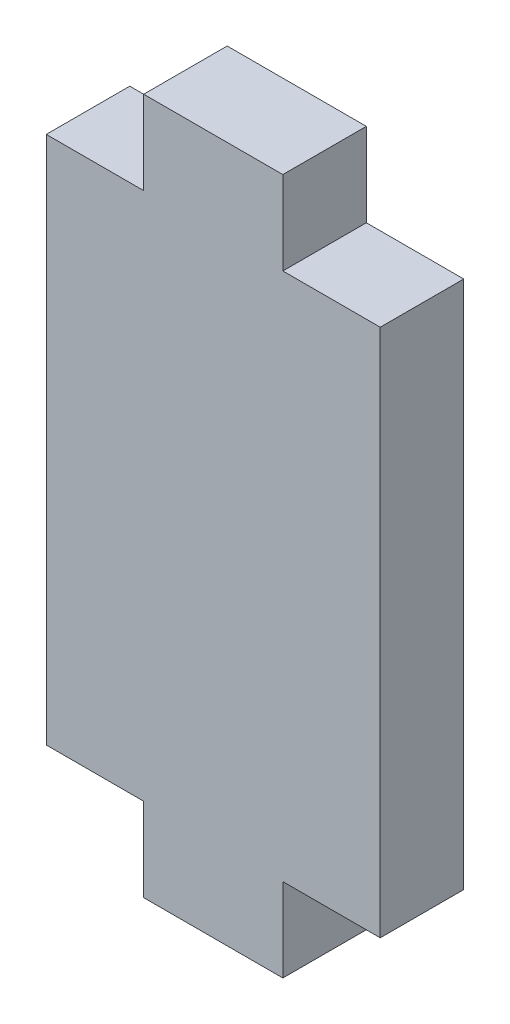
ISO-10303-21;
HEADER;
FILE_DESCRIPTION(('STEP AP214'),'2;1');
FILE_NAME('part.step','',(''),(''),'','','');
FILE_SCHEMA(('AUTOMOTIVE_DESIGN { 1 0 10303 214 1 1 1 1 }'));
ENDSEC;
DATA;
#1=APPLICATION_CONTEXT('core data for automotive mechanical design processes');
#2=APPLICATION_PROTOCOL_DEFINITION('international standard','automotive_design',2000,#1);
#3=PRODUCT_CONTEXT('',#1,'mechanical');
#4=PRODUCT('Part','Part','',(#3));
#5=PRODUCT_RELATED_PRODUCT_CATEGORY('part','',(#4));
#6=PRODUCT_DEFINITION_FORMATION('','',#4);
#7=PRODUCT_DEFINITION_CONTEXT('part definition',#1,'design');
#8=PRODUCT_DEFINITION('design','',#6,#7);
#9=PRODUCT_DEFINITION_SHAPE('','',#8);
#10=(LENGTH_UNIT() NAMED_UNIT(*) SI_UNIT(.MILLI.,.METRE.));
#11=(NAMED_UNIT(*) PLANE_ANGLE_UNIT() SI_UNIT($,.RADIAN.));
#12=(NAMED_UNIT(*) SI_UNIT($,.STERADIAN.) SOLID_ANGLE_UNIT());
#13=UNCERTAINTY_MEASURE_WITH_UNIT(LENGTH_MEASURE(1.E-05),#10,'distance_accuracy_value','');
#14=(GEOMETRIC_REPRESENTATION_CONTEXT(3) GLOBAL_UNCERTAINTY_ASSIGNED_CONTEXT((#13)) GLOBAL_UNIT_ASSIGNED_CONTEXT((#10,
#11,#12)) REPRESENTATION_CONTEXT('',''));
#15=CARTESIAN_POINT('',(0.,0.,0.));
#16=DIRECTION('',(0.,0.,1.));
#17=DIRECTION('',(1.,0.,0.));
#18=AXIS2_PLACEMENT_3D('',#15,#16,#17);
#19=CARTESIAN_POINT('',(6.,-9.49999999999999,3.));
#20=DIRECTION('',(0.,1.,0.));
#21=DIRECTION('',(0.,0.,1.));
#22=AXIS2_PLACEMENT_3D('',#19,#20,#21);
#23=PLANE('',#22);
#24=DIRECTION('',(1.,0.,0.));
#25=VECTOR('',#24,1.);
#26=CARTESIAN_POINT('',(6.,-9.49999999999999,0.));
#27=LINE('',#26,#25);
#28=CARTESIAN_POINT('',(2.5,-9.49999999999999,0.));
#29=VERTEX_POINT('',#28);
#30=CARTESIAN_POINT('',(6.,-9.49999999999999,0.));
#31=VERTEX_POINT('',#30);
#32=EDGE_CURVE('E154',#29,#31,#27,.T.);
#33=ORIENTED_EDGE('',*,*,#32,.T.);
#34=DIRECTION('',(0.,0.,-1.));
#35=VECTOR('',#34,1.);
#36=CARTESIAN_POINT('',(6.,-9.49999999999999,3.));
#37=LINE('',#36,#35);
#38=CARTESIAN_POINT('',(6.,-9.49999999999999,3.));
#39=VERTEX_POINT('',#38);
#40=EDGE_CURVE('E11',#39,#31,#37,.T.);
#41=ORIENTED_EDGE('',*,*,#40,.F.);
#42=DIRECTION('',(1.,0.,0.));
#43=VECTOR('',#42,1.);
#44=CARTESIAN_POINT('',(6.,-9.49999999999999,3.));
#45=LINE('',#44,#43);
#46=CARTESIAN_POINT('',(2.5,-9.49999999999999,3.));
#47=VERTEX_POINT('',#46);
#48=EDGE_CURVE('E176',#47,#39,#45,.T.);
#49=ORIENTED_EDGE('',*,*,#48,.F.);
#50=DIRECTION('',(0.,0.,-1.));
#51=VECTOR('',#50,1.);
#52=CARTESIAN_POINT('',(2.5,-9.49999999999999,3.));
#53=LINE('',#52,#51);
#54=EDGE_CURVE('E150',#47,#29,#53,.T.);
#55=ORIENTED_EDGE('',*,*,#54,.T.);
#56=EDGE_LOOP('',(#33,#41,#49,#55));
#57=FACE_BOUND('',#56,.T.);
#58=ADVANCED_FACE('F34',(#57),#23,.F.);
#59=CARTESIAN_POINT('',(6.,9.50000000000001,3.));
#60=DIRECTION('',(-1.,0.,0.));
#61=DIRECTION('',(0.,-1.,0.));
#62=AXIS2_PLACEMENT_3D('',#59,#60,#61);
#63=PLANE('',#62);
#64=DIRECTION('',(0.,1.,0.));
#65=VECTOR('',#64,1.);
#66=CARTESIAN_POINT('',(6.,9.50000000000001,0.));
#67=LINE('',#66,#65);
#68=CARTESIAN_POINT('',(6.,9.50000000000001,0.));
#69=VERTEX_POINT('',#68);
#70=EDGE_CURVE('E157',#31,#69,#67,.T.);
#71=ORIENTED_EDGE('',*,*,#70,.T.);
#72=DIRECTION('',(0.,0.,-1.));
#73=VECTOR('',#72,1.);
#74=CARTESIAN_POINT('',(6.,9.50000000000001,3.));
#75=LINE('',#74,#73);
#76=CARTESIAN_POINT('',(6.,9.50000000000001,3.));
#77=VERTEX_POINT('',#76);
#78=EDGE_CURVE('E42',#77,#69,#75,.T.);
#79=ORIENTED_EDGE('',*,*,#78,.F.);
#80=DIRECTION('',(0.,1.,0.));
#81=VECTOR('',#80,1.);
#82=CARTESIAN_POINT('',(6.,9.50000000000001,3.));
#83=LINE('',#82,#81);
#84=EDGE_CURVE('E105',#39,#77,#83,.T.);
#85=ORIENTED_EDGE('',*,*,#84,.F.);
#86=ORIENTED_EDGE('',*,*,#40,.T.);
#87=EDGE_LOOP('',(#71,#79,#85,#86));
#88=FACE_BOUND('',#87,.T.);
#89=ADVANCED_FACE('F254',(#88),#63,.F.);
#90=CARTESIAN_POINT('',(2.5,9.50000000000001,3.));
#91=DIRECTION('',(0.,-1.,0.));
#92=DIRECTION('',(0.,0.,-1.));
#93=AXIS2_PLACEMENT_3D('',#90,#91,#92);
#94=PLANE('',#93);
#95=DIRECTION('',(-1.,0.,0.));
#96=VECTOR('',#95,1.);
#97=CARTESIAN_POINT('',(2.5,9.50000000000001,0.));
#98=LINE('',#97,#96);
#99=CARTESIAN_POINT('',(2.5,9.50000000000001,0.));
#100=VERTEX_POINT('',#99);
#101=EDGE_CURVE('E159',#69,#100,#98,.T.);
#102=ORIENTED_EDGE('',*,*,#101,.T.);
#103=DIRECTION('',(0.,0.,-1.));
#104=VECTOR('',#103,1.);
#105=CARTESIAN_POINT('',(2.5,9.50000000000001,3.));
#106=LINE('',#105,#104);
#107=CARTESIAN_POINT('',(2.5,9.50000000000001,3.));
#108=VERTEX_POINT('',#107);
#109=EDGE_CURVE('E195',#108,#100,#106,.T.);
#110=ORIENTED_EDGE('',*,*,#109,.F.);
#111=DIRECTION('',(-1.,0.,0.));
#112=VECTOR('',#111,1.);
#113=CARTESIAN_POINT('',(2.5,9.50000000000001,3.));
#114=LINE('',#113,#112);
#115=EDGE_CURVE('E203',#77,#108,#114,.T.);
#116=ORIENTED_EDGE('',*,*,#115,.F.);
#117=ORIENTED_EDGE('',*,*,#78,.T.);
#118=EDGE_LOOP('',(#102,#110,#116,#117));
#119=FACE_BOUND('',#118,.T.);
#120=ADVANCED_FACE('F201',(#119),#94,.F.);
#121=CARTESIAN_POINT('',(2.5,12.5,3.));
#122=DIRECTION('',(-1.,0.,0.));
#123=DIRECTION('',(0.,-1.,0.));
#124=AXIS2_PLACEMENT_3D('',#121,#122,#123);
#125=PLANE('',#124);
#126=DIRECTION('',(0.,1.,0.));
#127=VECTOR('',#126,1.);
#128=CARTESIAN_POINT('',(2.5,12.5,0.));
#129=LINE('',#128,#127);
#130=CARTESIAN_POINT('',(2.5,12.5,0.));
#131=VERTEX_POINT('',#130);
#132=EDGE_CURVE('E161',#100,#131,#129,.T.);
#133=ORIENTED_EDGE('',*,*,#132,.T.);
#134=DIRECTION('',(0.,0.,-1.));
#135=VECTOR('',#134,1.);
#136=CARTESIAN_POINT('',(2.5,12.5,3.));
#137=LINE('',#136,#135);
#138=CARTESIAN_POINT('',(2.5,12.5,3.));
#139=VERTEX_POINT('',#138);
#140=EDGE_CURVE('E192',#139,#131,#137,.T.);
#141=ORIENTED_EDGE('',*,*,#140,.F.);
#142=DIRECTION('',(0.,1.,0.));
#143=VECTOR('',#142,1.);
#144=CARTESIAN_POINT('',(2.5,12.5,3.));
#145=LINE('',#144,#143);
#146=EDGE_CURVE('E221',#108,#139,#145,.T.);
#147=ORIENTED_EDGE('',*,*,#146,.F.);
#148=ORIENTED_EDGE('',*,*,#109,.T.);
#149=EDGE_LOOP('',(#133,#141,#147,#148));
#150=FACE_BOUND('',#149,.T.);
#151=ADVANCED_FACE('F212',(#150),#125,.F.);
#152=CARTESIAN_POINT('',(-2.5,12.5,3.));
#153=DIRECTION('',(0.,-1.,0.));
#154=DIRECTION('',(0.,0.,-1.));
#155=AXIS2_PLACEMENT_3D('',#152,#153,#154);
#156=PLANE('',#155);
#157=DIRECTION('',(-1.,0.,0.));
#158=VECTOR('',#157,1.);
#159=CARTESIAN_POINT('',(-2.5,12.5,0.));
#160=LINE('',#159,#158);
#161=CARTESIAN_POINT('',(-2.5,12.5,0.));
#162=VERTEX_POINT('',#161);
#163=EDGE_CURVE('E163',#131,#162,#160,.T.);
#164=ORIENTED_EDGE('',*,*,#163,.T.);
#165=DIRECTION('',(0.,0.,-1.));
#166=VECTOR('',#165,1.);
#167=CARTESIAN_POINT('',(-2.5,12.5,3.));
#168=LINE('',#167,#166);
#169=CARTESIAN_POINT('',(-2.5,12.5,3.));
#170=VERTEX_POINT('',#169);
#171=EDGE_CURVE('E189',#170,#162,#168,.T.);
#172=ORIENTED_EDGE('',*,*,#171,.F.);
#173=DIRECTION('',(-1.,0.,0.));
#174=VECTOR('',#173,1.);
#175=CARTESIAN_POINT('',(-2.5,12.5,3.));
#176=LINE('',#175,#174);
#177=EDGE_CURVE('E218',#139,#170,#176,.T.);
#178=ORIENTED_EDGE('',*,*,#177,.F.);
#179=ORIENTED_EDGE('',*,*,#140,.T.);
#180=EDGE_LOOP('',(#164,#172,#178,#179));
#181=FACE_BOUND('',#180,.T.);
#182=ADVANCED_FACE('F216',(#181),#156,.F.);
#183=CARTESIAN_POINT('',(-2.5,9.50000000000001,3.));
#184=DIRECTION('',(1.,0.,0.));
#185=DIRECTION('',(0.,1.,0.));
#186=AXIS2_PLACEMENT_3D('',#183,#184,#185);
#187=PLANE('',#186);
#188=DIRECTION('',(0.,-1.,0.));
#189=VECTOR('',#188,1.);
#190=CARTESIAN_POINT('',(-2.5,9.50000000000001,0.));
#191=LINE('',#190,#189);
#192=CARTESIAN_POINT('',(-2.5,9.50000000000001,0.));
#193=VERTEX_POINT('',#192);
#194=EDGE_CURVE('E165',#162,#193,#191,.T.);
#195=ORIENTED_EDGE('',*,*,#194,.T.);
#196=DIRECTION('',(0.,0.,-1.));
#197=VECTOR('',#196,1.);
#198=CARTESIAN_POINT('',(-2.5,9.50000000000001,3.));
#199=LINE('',#198,#197);
#200=CARTESIAN_POINT('',(-2.5,9.50000000000001,3.));
#201=VERTEX_POINT('',#200);
#202=EDGE_CURVE('E186',#201,#193,#199,.T.);
#203=ORIENTED_EDGE('',*,*,#202,.F.);
#204=DIRECTION('',(0.,-1.,0.));
#205=VECTOR('',#204,1.);
#206=CARTESIAN_POINT('',(-2.5,9.50000000000001,3.));
#207=LINE('',#206,#205);
#208=EDGE_CURVE('E220',#170,#201,#207,.T.);
#209=ORIENTED_EDGE('',*,*,#208,.F.);
#210=ORIENTED_EDGE('',*,*,#171,.T.);
#211=EDGE_LOOP('',(#195,#203,#209,#210));
#212=FACE_BOUND('',#211,.T.);
#213=ADVANCED_FACE('F267',(#212),#187,.F.);
#214=CARTESIAN_POINT('',(-6.,9.50000000000001,3.));
#215=DIRECTION('',(0.,-1.,0.));
#216=DIRECTION('',(1.,0.,0.));
#217=AXIS2_PLACEMENT_3D('',#214,#215,#216);
#218=PLANE('',#217);
#219=DIRECTION('',(-1.,0.,0.));
#220=VECTOR('',#219,1.);
#221=CARTESIAN_POINT('',(-6.,9.50000000000001,0.));
#222=LINE('',#221,#220);
#223=CARTESIAN_POINT('',(-6.,9.50000000000001,0.));
#224=VERTEX_POINT('',#223);
#225=EDGE_CURVE('E167',#193,#224,#222,.T.);
#226=ORIENTED_EDGE('',*,*,#225,.T.);
#227=DIRECTION('',(0.,0.,-1.));
#228=VECTOR('',#227,1.);
#229=CARTESIAN_POINT('',(-6.,9.50000000000001,3.));
#230=LINE('',#229,#228);
#231=CARTESIAN_POINT('',(-6.,9.50000000000001,3.));
#232=VERTEX_POINT('',#231);
#233=EDGE_CURVE('E183',#232,#224,#230,.T.);
#234=ORIENTED_EDGE('',*,*,#233,.F.);
#235=DIRECTION('',(-1.,0.,0.));
#236=VECTOR('',#235,1.);
#237=CARTESIAN_POINT('',(-6.,9.50000000000001,3.));
#238=LINE('',#237,#236);
#239=EDGE_CURVE('E223',#201,#232,#238,.T.);
#240=ORIENTED_EDGE('',*,*,#239,.F.);
#241=ORIENTED_EDGE('',*,*,#202,.T.);
#242=EDGE_LOOP('',(#226,#234,#240,#241));
#243=FACE_BOUND('',#242,.T.);
#244=ADVANCED_FACE('F270',(#243),#218,.F.);
#245=CARTESIAN_POINT('',(-6.,9.50000000000001,3.));
#246=DIRECTION('',(1.,0.,0.));
#247=DIRECTION('',(0.,1.,0.));
#248=AXIS2_PLACEMENT_3D('',#245,#246,#247);
#249=PLANE('',#248);
#250=DIRECTION('',(0.,-1.,0.));
#251=VECTOR('',#250,1.);
#252=CARTESIAN_POINT('',(-6.,9.50000000000001,0.));
#253=LINE('',#252,#251);
#254=CARTESIAN_POINT('',(-6.,-9.5,0.));
#255=VERTEX_POINT('',#254);
#256=EDGE_CURVE('E169',#224,#255,#253,.T.);
#257=ORIENTED_EDGE('',*,*,#256,.T.);
#258=DIRECTION('',(0.,0.,-1.));
#259=VECTOR('',#258,1.);
#260=CARTESIAN_POINT('',(-6.,-9.5,3.));
#261=LINE('',#260,#259);
#262=CARTESIAN_POINT('',(-6.,-9.5,3.));
#263=VERTEX_POINT('',#262);
#264=EDGE_CURVE('E180',#263,#255,#261,.T.);
#265=ORIENTED_EDGE('',*,*,#264,.F.);
#266=DIRECTION('',(0.,-1.,0.));
#267=VECTOR('',#266,1.);
#268=CARTESIAN_POINT('',(-6.,9.50000000000001,3.));
#269=LINE('',#268,#267);
#270=EDGE_CURVE('E229',#232,#263,#269,.T.);
#271=ORIENTED_EDGE('',*,*,#270,.F.);
#272=ORIENTED_EDGE('',*,*,#233,.T.);
#273=EDGE_LOOP('',(#257,#265,#271,#272));
#274=FACE_BOUND('',#273,.T.);
#275=ADVANCED_FACE('F235',(#274),#249,.F.);
#276=CARTESIAN_POINT('',(-2.5,-9.5,3.));
#277=DIRECTION('',(0.,1.,0.));
#278=DIRECTION('',(-1.,0.,0.));
#279=AXIS2_PLACEMENT_3D('',#276,#277,#278);
#280=PLANE('',#279);
#281=DIRECTION('',(1.,0.,0.));
#282=VECTOR('',#281,1.);
#283=CARTESIAN_POINT('',(-2.5,-9.5,0.));
#284=LINE('',#283,#282);
#285=CARTESIAN_POINT('',(-2.5,-9.5,0.));
#286=VERTEX_POINT('',#285);
#287=EDGE_CURVE('E171',#255,#286,#284,.T.);
#288=ORIENTED_EDGE('',*,*,#287,.T.);
#289=DIRECTION('',(0.,0.,-1.));
#290=VECTOR('',#289,1.);
#291=CARTESIAN_POINT('',(-2.5,-9.5,3.));
#292=LINE('',#291,#290);
#293=CARTESIAN_POINT('',(-2.5,-9.5,3.));
#294=VERTEX_POINT('',#293);
#295=EDGE_CURVE('E145',#294,#286,#292,.T.);
#296=ORIENTED_EDGE('',*,*,#295,.F.);
#297=DIRECTION('',(1.,0.,0.));
#298=VECTOR('',#297,1.);
#299=CARTESIAN_POINT('',(-2.5,-9.5,3.));
#300=LINE('',#299,#298);
#301=EDGE_CURVE('E136',#263,#294,#300,.T.);
#302=ORIENTED_EDGE('',*,*,#301,.F.);
#303=ORIENTED_EDGE('',*,*,#264,.T.);
#304=EDGE_LOOP('',(#288,#296,#302,#303));
#305=FACE_BOUND('',#304,.T.);
#306=ADVANCED_FACE('F239',(#305),#280,.F.);
#307=CARTESIAN_POINT('',(-2.5,-12.5,3.));
#308=DIRECTION('',(1.,0.,0.));
#309=DIRECTION('',(0.,0.,-1.));
#310=AXIS2_PLACEMENT_3D('',#307,#308,#309);
#311=PLANE('',#310);
#312=DIRECTION('',(0.,-1.,0.));
#313=VECTOR('',#312,1.);
#314=CARTESIAN_POINT('',(-2.5,-12.5,0.));
#315=LINE('',#314,#313);
#316=CARTESIAN_POINT('',(-2.5,-12.5,0.));
#317=VERTEX_POINT('',#316);
#318=EDGE_CURVE('E144',#286,#317,#315,.T.);
#319=ORIENTED_EDGE('',*,*,#318,.T.);
#320=DIRECTION('',(0.,0.,-1.));
#321=VECTOR('',#320,1.);
#322=CARTESIAN_POINT('',(-2.5,-12.5,3.));
#323=LINE('',#322,#321);
#324=CARTESIAN_POINT('',(-2.5,-12.5,3.));
#325=VERTEX_POINT('',#324);
#326=EDGE_CURVE('E141',#325,#317,#323,.T.);
#327=ORIENTED_EDGE('',*,*,#326,.F.);
#328=DIRECTION('',(0.,-1.,0.));
#329=VECTOR('',#328,1.);
#330=CARTESIAN_POINT('',(-2.5,-12.5,3.));
#331=LINE('',#330,#329);
#332=EDGE_CURVE('E130',#294,#325,#331,.T.);
#333=ORIENTED_EDGE('',*,*,#332,.F.);
#334=ORIENTED_EDGE('',*,*,#295,.T.);
#335=EDGE_LOOP('',(#319,#327,#333,#334));
#336=FACE_BOUND('',#335,.T.);
#337=ADVANCED_FACE('F142',(#336),#311,.F.);
#338=CARTESIAN_POINT('',(2.5,-12.5,3.));
#339=DIRECTION('',(0.,1.,0.));
#340=DIRECTION('',(0.,0.,1.));
#341=AXIS2_PLACEMENT_3D('',#338,#339,#340);
#342=PLANE('',#341);
#343=DIRECTION('',(1.,0.,0.));
#344=VECTOR('',#343,1.);
#345=CARTESIAN_POINT('',(2.5,-12.5,0.));
#346=LINE('',#345,#344);
#347=CARTESIAN_POINT('',(2.5,-12.5,0.));
#348=VERTEX_POINT('',#347);
#349=EDGE_CURVE('E91',#317,#348,#346,.T.);
#350=ORIENTED_EDGE('',*,*,#349,.T.);
#351=DIRECTION('',(0.,0.,-1.));
#352=VECTOR('',#351,1.);
#353=CARTESIAN_POINT('',(2.5,-12.5,3.));
#354=LINE('',#353,#352);
#355=CARTESIAN_POINT('',(2.5,-12.5,3.));
#356=VERTEX_POINT('',#355);
#357=EDGE_CURVE('E146',#356,#348,#354,.T.);
#358=ORIENTED_EDGE('',*,*,#357,.F.);
#359=DIRECTION('',(1.,0.,0.));
#360=VECTOR('',#359,1.);
#361=CARTESIAN_POINT('',(2.5,-12.5,3.));
#362=LINE('',#361,#360);
#363=EDGE_CURVE('E134',#325,#356,#362,.T.);
#364=ORIENTED_EDGE('',*,*,#363,.F.);
#365=ORIENTED_EDGE('',*,*,#326,.T.);
#366=EDGE_LOOP('',(#350,#358,#364,#365));
#367=FACE_BOUND('',#366,.T.);
#368=ADVANCED_FACE('F148',(#367),#342,.F.);
#369=CARTESIAN_POINT('',(2.5,-9.49999999999999,3.));
#370=DIRECTION('',(-1.,0.,0.));
#371=DIRECTION('',(0.,-1.,0.));
#372=AXIS2_PLACEMENT_3D('',#369,#370,#371);
#373=PLANE('',#372);
#374=DIRECTION('',(0.,1.,0.));
#375=VECTOR('',#374,1.);
#376=CARTESIAN_POINT('',(2.5,-9.49999999999999,0.));
#377=LINE('',#376,#375);
#378=EDGE_CURVE('E97',#348,#29,#377,.T.);
#379=ORIENTED_EDGE('',*,*,#378,.T.);
#380=ORIENTED_EDGE('',*,*,#54,.F.);
#381=DIRECTION('',(0.,1.,0.));
#382=VECTOR('',#381,1.);
#383=CARTESIAN_POINT('',(2.5,-9.49999999999999,3.));
#384=LINE('',#383,#382);
#385=EDGE_CURVE('E50',#356,#47,#384,.T.);
#386=ORIENTED_EDGE('',*,*,#385,.F.);
#387=ORIENTED_EDGE('',*,*,#357,.T.);
#388=EDGE_LOOP('',(#379,#380,#386,#387));
#389=FACE_BOUND('',#388,.T.);
#390=ADVANCED_FACE('F243',(#389),#373,.F.);
#391=CARTESIAN_POINT('',(0.,0.,3.));
#392=DIRECTION('',(0.,0.,1.));
#393=DIRECTION('',(1.,0.,0.));
#394=AXIS2_PLACEMENT_3D('',#391,#392,#393);
#395=PLANE('',#394);
#396=ORIENTED_EDGE('',*,*,#48,.T.);
#397=ORIENTED_EDGE('',*,*,#84,.T.);
#398=ORIENTED_EDGE('',*,*,#115,.T.);
#399=ORIENTED_EDGE('',*,*,#146,.T.);
#400=ORIENTED_EDGE('',*,*,#177,.T.);
#401=ORIENTED_EDGE('',*,*,#208,.T.);
#402=ORIENTED_EDGE('',*,*,#239,.T.);
#403=ORIENTED_EDGE('',*,*,#270,.T.);
#404=ORIENTED_EDGE('',*,*,#301,.T.);
#405=ORIENTED_EDGE('',*,*,#332,.T.);
#406=ORIENTED_EDGE('',*,*,#363,.T.);
#407=ORIENTED_EDGE('',*,*,#385,.T.);
#408=EDGE_LOOP('',(#396,#397,#398,#399,#400,#401,#402,#403,#404,#405,#406,#407));
#409=FACE_BOUND('',#408,.T.);
#410=ADVANCED_FACE('F132',(#409),#395,.T.);
#411=CARTESIAN_POINT('',(0.,0.,0.));
#412=DIRECTION('',(0.,0.,1.));
#413=DIRECTION('',(1.,0.,0.));
#414=AXIS2_PLACEMENT_3D('',#411,#412,#413);
#415=PLANE('',#414);
#416=ORIENTED_EDGE('',*,*,#32,.F.);
#417=ORIENTED_EDGE('',*,*,#378,.F.);
#418=ORIENTED_EDGE('',*,*,#349,.F.);
#419=ORIENTED_EDGE('',*,*,#318,.F.);
#420=ORIENTED_EDGE('',*,*,#287,.F.);
#421=ORIENTED_EDGE('',*,*,#256,.F.);
#422=ORIENTED_EDGE('',*,*,#225,.F.);
#423=ORIENTED_EDGE('',*,*,#194,.F.);
#424=ORIENTED_EDGE('',*,*,#163,.F.);
#425=ORIENTED_EDGE('',*,*,#132,.F.);
#426=ORIENTED_EDGE('',*,*,#101,.F.);
#427=ORIENTED_EDGE('',*,*,#70,.F.);
#428=EDGE_LOOP('',(#416,#417,#418,#419,#420,#421,#422,#423,#424,#425,#426,#427));
#429=FACE_BOUND('',#428,.T.);
#430=ADVANCED_FACE('F207',(#429),#415,.F.);
#431=CLOSED_SHELL('',(#58,#89,#120,#151,#182,#213,#244,#275,#306,#337,#368,#390,#410,#430));
#432=MANIFOLD_SOLID_BREP('B2',#431);
#433=ADVANCED_BREP_SHAPE_REPRESENTATION('',(#18,#432),#14);
#434=SHAPE_DEFINITION_REPRESENTATION(#9,#433);
ENDSEC;
END-ISO-10303-21;
